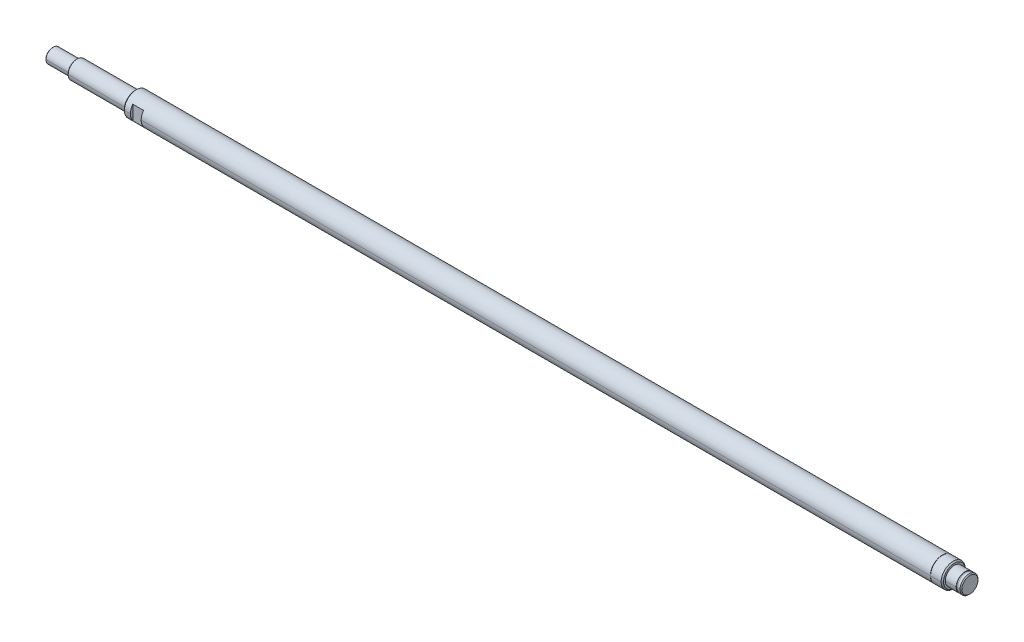
ISO-10303-21;
HEADER;
FILE_DESCRIPTION(('STEP AP214'),'2;1');
FILE_NAME('part.step','',(''),(''),'','','');
FILE_SCHEMA(('AUTOMOTIVE_DESIGN { 1 0 10303 214 1 1 1 1 }'));
ENDSEC;
DATA;
#1=APPLICATION_CONTEXT('core data for automotive mechanical design processes');
#2=APPLICATION_PROTOCOL_DEFINITION('international standard','automotive_design',2000,#1);
#3=PRODUCT_CONTEXT('',#1,'mechanical');
#4=PRODUCT('Part','Part','',(#3));
#5=PRODUCT_RELATED_PRODUCT_CATEGORY('part','',(#4));
#6=PRODUCT_DEFINITION_FORMATION('','',#4);
#7=PRODUCT_DEFINITION_CONTEXT('part definition',#1,'design');
#8=PRODUCT_DEFINITION('design','',#6,#7);
#9=PRODUCT_DEFINITION_SHAPE('','',#8);
#10=(LENGTH_UNIT() NAMED_UNIT(*) SI_UNIT(.MILLI.,.METRE.));
#11=(NAMED_UNIT(*) PLANE_ANGLE_UNIT() SI_UNIT($,.RADIAN.));
#12=(NAMED_UNIT(*) SI_UNIT($,.STERADIAN.) SOLID_ANGLE_UNIT());
#13=UNCERTAINTY_MEASURE_WITH_UNIT(LENGTH_MEASURE(1.E-05),#10,'distance_accuracy_value','');
#14=(GEOMETRIC_REPRESENTATION_CONTEXT(3) GLOBAL_UNCERTAINTY_ASSIGNED_CONTEXT((#13)) GLOBAL_UNIT_ASSIGNED_CONTEXT((#10,
#11,#12)) REPRESENTATION_CONTEXT('',''));
#15=CARTESIAN_POINT('',(0.,0.,0.));
#16=DIRECTION('',(0.,0.,1.));
#17=DIRECTION('',(1.,0.,0.));
#18=AXIS2_PLACEMENT_3D('',#15,#16,#17);
#19=CARTESIAN_POINT('',(658.5,0.,0.));
#20=DIRECTION('',(1.,0.,0.));
#21=DIRECTION('',(0.,1.,0.));
#22=AXIS2_PLACEMENT_3D('',#19,#20,#21);
#23=CYLINDRICAL_SURFACE('',#22,10.);
#24=DIRECTION('',(1.,0.,0.));
#25=VECTOR('',#24,1.);
#26=CARTESIAN_POINT('',(-14.,0.,10.));
#27=LINE('',#26,#25);
#28=CARTESIAN_POINT('',(-14.,0.,10.));
#29=VERTEX_POINT('',#28);
#30=CARTESIAN_POINT('',(-9.,0.,10.));
#31=VERTEX_POINT('',#30);
#32=EDGE_CURVE('E11',#29,#31,#27,.T.);
#33=ORIENTED_EDGE('',*,*,#32,.F.);
#34=CARTESIAN_POINT('',(-14.,0.,0.));
#35=DIRECTION('',(1.,0.,0.));
#36=DIRECTION('',(0.,0.,-1.));
#37=AXIS2_PLACEMENT_3D('',#34,#35,#36);
#38=CIRCLE('',#37,10.);
#39=CARTESIAN_POINT('',(-14.,0.,-10.));
#40=VERTEX_POINT('',#39);
#41=EDGE_CURVE('E25',#29,#40,#38,.T.);
#42=ORIENTED_EDGE('',*,*,#41,.T.);
#43=DIRECTION('',(1.,0.,0.));
#44=VECTOR('',#43,1.);
#45=CARTESIAN_POINT('',(-14.,0.,-10.));
#46=LINE('',#45,#44);
#47=CARTESIAN_POINT('',(-9.,0.,-10.));
#48=VERTEX_POINT('',#47);
#49=EDGE_CURVE('E588',#40,#48,#46,.T.);
#50=ORIENTED_EDGE('',*,*,#49,.T.);
#51=CARTESIAN_POINT('',(-9.,0.,0.));
#52=DIRECTION('',(-1.,0.,0.));
#53=DIRECTION('',(0.,0.,1.));
#54=AXIS2_PLACEMENT_3D('',#51,#52,#53);
#55=CIRCLE('',#54,10.);
#56=CARTESIAN_POINT('',(-9.,-6.,-8.));
#57=VERTEX_POINT('',#56);
#58=EDGE_CURVE('E584',#48,#57,#55,.T.);
#59=ORIENTED_EDGE('',*,*,#58,.T.);
#60=DIRECTION('',(1.,0.,0.));
#61=VECTOR('',#60,1.);
#62=CARTESIAN_POINT('',(658.5,-6.,-8.));
#63=LINE('',#62,#61);
#64=CARTESIAN_POINT('',(0.,-6.,-8.));
#65=VERTEX_POINT('',#64);
#66=EDGE_CURVE('E580',#57,#65,#63,.T.);
#67=ORIENTED_EDGE('',*,*,#66,.T.);
#68=CARTESIAN_POINT('',(0.,0.,0.));
#69=DIRECTION('',(1.,0.,0.));
#70=DIRECTION('',(0.,0.,-1.));
#71=AXIS2_PLACEMENT_3D('',#68,#69,#70);
#72=CIRCLE('',#71,10.);
#73=CARTESIAN_POINT('',(0.,0.,-10.));
#74=VERTEX_POINT('',#73);
#75=EDGE_CURVE('E576',#65,#74,#72,.T.);
#76=ORIENTED_EDGE('',*,*,#75,.T.);
#77=DIRECTION('',(1.,0.,0.));
#78=VECTOR('',#77,1.);
#79=CARTESIAN_POINT('',(0.,0.,-10.));
#80=LINE('',#79,#78);
#81=CARTESIAN_POINT('',(658.5,0.,-10.));
#82=VERTEX_POINT('',#81);
#83=EDGE_CURVE('E572',#74,#82,#80,.T.);
#84=ORIENTED_EDGE('',*,*,#83,.T.);
#85=CARTESIAN_POINT('',(658.5,0.,0.));
#86=DIRECTION('',(1.,0.,0.));
#87=DIRECTION('',(0.,0.,-1.));
#88=AXIS2_PLACEMENT_3D('',#85,#86,#87);
#89=CIRCLE('',#88,10.);
#90=CARTESIAN_POINT('',(658.5,0.,10.));
#91=VERTEX_POINT('',#90);
#92=EDGE_CURVE('E567',#91,#82,#89,.T.);
#93=ORIENTED_EDGE('',*,*,#92,.F.);
#94=DIRECTION('',(1.,0.,0.));
#95=VECTOR('',#94,1.);
#96=CARTESIAN_POINT('',(0.,0.,10.));
#97=LINE('',#96,#95);
#98=CARTESIAN_POINT('',(0.,0.,10.));
#99=VERTEX_POINT('',#98);
#100=EDGE_CURVE('E562',#99,#91,#97,.T.);
#101=ORIENTED_EDGE('',*,*,#100,.F.);
#102=CARTESIAN_POINT('',(0.,0.,0.));
#103=DIRECTION('',(-1.,0.,0.));
#104=DIRECTION('',(0.,0.,1.));
#105=AXIS2_PLACEMENT_3D('',#102,#103,#104);
#106=CIRCLE('',#105,10.);
#107=CARTESIAN_POINT('',(0.,-6.,8.));
#108=VERTEX_POINT('',#107);
#109=EDGE_CURVE('E557',#108,#99,#106,.T.);
#110=ORIENTED_EDGE('',*,*,#109,.F.);
#111=DIRECTION('',(1.,0.,0.));
#112=VECTOR('',#111,1.);
#113=CARTESIAN_POINT('',(658.5,-6.,8.));
#114=LINE('',#113,#112);
#115=CARTESIAN_POINT('',(-9.,-6.,8.));
#116=VERTEX_POINT('',#115);
#117=EDGE_CURVE('E552',#116,#108,#114,.T.);
#118=ORIENTED_EDGE('',*,*,#117,.F.);
#119=CARTESIAN_POINT('',(-9.,0.,0.));
#120=DIRECTION('',(1.,0.,0.));
#121=DIRECTION('',(0.,0.,-1.));
#122=AXIS2_PLACEMENT_3D('',#119,#120,#121);
#123=CIRCLE('',#122,10.);
#124=EDGE_CURVE('E547',#31,#116,#123,.T.);
#125=ORIENTED_EDGE('',*,*,#124,.F.);
#126=EDGE_LOOP('',(#33,#42,#50,#59,#67,#76,#84,#93,#101,#110,#118,#125));
#127=FACE_BOUND('',#126,.T.);
#128=ADVANCED_FACE('F17',(#127),#23,.T.);
#129=CARTESIAN_POINT('',(-9.,10.,12.));
#130=DIRECTION('',(1.,0.,0.));
#131=DIRECTION('',(0.,0.,-1.));
#132=AXIS2_PLACEMENT_3D('',#129,#130,#131);
#133=PLANE('',#132);
#134=CARTESIAN_POINT('',(-9.,0.,0.));
#135=DIRECTION('',(1.,0.,0.));
#136=DIRECTION('',(0.,0.,-1.));
#137=AXIS2_PLACEMENT_3D('',#134,#135,#136);
#138=CIRCLE('',#137,10.);
#139=CARTESIAN_POINT('',(-9.,6.,8.));
#140=VERTEX_POINT('',#139);
#141=EDGE_CURVE('E542',#140,#31,#138,.T.);
#142=ORIENTED_EDGE('',*,*,#141,.T.);
#143=ORIENTED_EDGE('',*,*,#124,.T.);
#144=DIRECTION('',(0.,-1.,0.));
#145=VECTOR('',#144,1.);
#146=CARTESIAN_POINT('',(-9.,10.,8.));
#147=LINE('',#146,#145);
#148=EDGE_CURVE('E537',#140,#116,#147,.T.);
#149=ORIENTED_EDGE('',*,*,#148,.F.);
#150=EDGE_LOOP('',(#142,#143,#149));
#151=FACE_BOUND('',#150,.T.);
#152=ADVANCED_FACE('F626',(#151),#133,.T.);
#153=CARTESIAN_POINT('',(0.,0.,8.));
#154=DIRECTION('',(0.,0.,1.));
#155=DIRECTION('',(1.,0.,0.));
#156=AXIS2_PLACEMENT_3D('',#153,#154,#155);
#157=PLANE('',#156);
#158=ORIENTED_EDGE('',*,*,#117,.T.);
#159=DIRECTION('',(0.,1.,0.));
#160=VECTOR('',#159,1.);
#161=CARTESIAN_POINT('',(0.,-10.,8.));
#162=LINE('',#161,#160);
#163=CARTESIAN_POINT('',(0.,6.,8.));
#164=VERTEX_POINT('',#163);
#165=EDGE_CURVE('E533',#108,#164,#162,.T.);
#166=ORIENTED_EDGE('',*,*,#165,.T.);
#167=DIRECTION('',(-1.,0.,0.));
#168=VECTOR('',#167,1.);
#169=CARTESIAN_POINT('',(658.5,6.,8.));
#170=LINE('',#169,#168);
#171=EDGE_CURVE('E528',#164,#140,#170,.T.);
#172=ORIENTED_EDGE('',*,*,#171,.T.);
#173=ORIENTED_EDGE('',*,*,#148,.T.);
#174=EDGE_LOOP('',(#158,#166,#172,#173));
#175=FACE_BOUND('',#174,.T.);
#176=ADVANCED_FACE('F624',(#175),#157,.T.);
#177=CARTESIAN_POINT('',(658.5,0.,0.));
#178=DIRECTION('',(1.,0.,0.));
#179=DIRECTION('',(0.,-1.,0.));
#180=AXIS2_PLACEMENT_3D('',#177,#178,#179);
#181=CYLINDRICAL_SURFACE('',#180,10.);
#182=ORIENTED_EDGE('',*,*,#32,.T.);
#183=ORIENTED_EDGE('',*,*,#141,.F.);
#184=ORIENTED_EDGE('',*,*,#171,.F.);
#185=CARTESIAN_POINT('',(0.,0.,0.));
#186=DIRECTION('',(-1.,0.,0.));
#187=DIRECTION('',(0.,0.,1.));
#188=AXIS2_PLACEMENT_3D('',#185,#186,#187);
#189=CIRCLE('',#188,10.);
#190=EDGE_CURVE('E523',#99,#164,#189,.T.);
#191=ORIENTED_EDGE('',*,*,#190,.F.);
#192=ORIENTED_EDGE('',*,*,#100,.T.);
#193=CARTESIAN_POINT('',(658.5,0.,0.));
#194=DIRECTION('',(1.,0.,0.));
#195=DIRECTION('',(0.,0.,-1.));
#196=AXIS2_PLACEMENT_3D('',#193,#194,#195);
#197=CIRCLE('',#196,10.);
#198=EDGE_CURVE('E518',#82,#91,#197,.T.);
#199=ORIENTED_EDGE('',*,*,#198,.F.);
#200=ORIENTED_EDGE('',*,*,#83,.F.);
#201=CARTESIAN_POINT('',(0.,0.,0.));
#202=DIRECTION('',(1.,0.,0.));
#203=DIRECTION('',(0.,0.,-1.));
#204=AXIS2_PLACEMENT_3D('',#201,#202,#203);
#205=CIRCLE('',#204,10.);
#206=CARTESIAN_POINT('',(0.,6.,-8.));
#207=VERTEX_POINT('',#206);
#208=EDGE_CURVE('E514',#74,#207,#205,.T.);
#209=ORIENTED_EDGE('',*,*,#208,.T.);
#210=DIRECTION('',(-1.,0.,0.));
#211=VECTOR('',#210,1.);
#212=CARTESIAN_POINT('',(658.5,6.,-8.));
#213=LINE('',#212,#211);
#214=CARTESIAN_POINT('',(-9.,6.,-8.));
#215=VERTEX_POINT('',#214);
#216=EDGE_CURVE('E510',#207,#215,#213,.T.);
#217=ORIENTED_EDGE('',*,*,#216,.T.);
#218=CARTESIAN_POINT('',(-9.,0.,0.));
#219=DIRECTION('',(-1.,0.,0.));
#220=DIRECTION('',(0.,0.,1.));
#221=AXIS2_PLACEMENT_3D('',#218,#219,#220);
#222=CIRCLE('',#221,10.);
#223=EDGE_CURVE('E505',#215,#48,#222,.T.);
#224=ORIENTED_EDGE('',*,*,#223,.T.);
#225=ORIENTED_EDGE('',*,*,#49,.F.);
#226=CARTESIAN_POINT('',(-14.,0.,0.));
#227=DIRECTION('',(1.,0.,0.));
#228=DIRECTION('',(0.,0.,-1.));
#229=AXIS2_PLACEMENT_3D('',#226,#227,#228);
#230=CIRCLE('',#229,10.);
#231=EDGE_CURVE('E501',#40,#29,#230,.T.);
#232=ORIENTED_EDGE('',*,*,#231,.T.);
#233=EDGE_LOOP('',(#182,#183,#184,#191,#192,#199,#200,#209,#217,#224,#225,#232));
#234=FACE_BOUND('',#233,.T.);
#235=ADVANCED_FACE('F600',(#234),#181,.T.);
#236=CARTESIAN_POINT('',(-15.,0.,0.));
#237=DIRECTION('',(1.,0.,0.));
#238=DIRECTION('',(0.,-1.,0.));
#239=AXIS2_PLACEMENT_3D('',#236,#237,#238);
#240=CONICAL_SURFACE('',#239,9.,0.785398163397448);
#241=DIRECTION('',(0.707106781186548,0.,0.707106781186547));
#242=VECTOR('',#241,1.);
#243=CARTESIAN_POINT('',(-15.,0.,9.));
#244=LINE('',#243,#242);
#245=CARTESIAN_POINT('',(-15.,0.,9.));
#246=VERTEX_POINT('',#245);
#247=EDGE_CURVE('E496',#246,#29,#244,.T.);
#248=ORIENTED_EDGE('',*,*,#247,.T.);
#249=ORIENTED_EDGE('',*,*,#231,.F.);
#250=DIRECTION('',(0.707106781186548,0.,-0.707106781186547));
#251=VECTOR('',#250,1.);
#252=CARTESIAN_POINT('',(-15.,0.,-9.));
#253=LINE('',#252,#251);
#254=CARTESIAN_POINT('',(-15.,0.,-9.));
#255=VERTEX_POINT('',#254);
#256=EDGE_CURVE('E492',#255,#40,#253,.T.);
#257=ORIENTED_EDGE('',*,*,#256,.F.);
#258=CARTESIAN_POINT('',(-15.,0.,0.));
#259=DIRECTION('',(1.,0.,0.));
#260=DIRECTION('',(0.,0.,-1.));
#261=AXIS2_PLACEMENT_3D('',#258,#259,#260);
#262=CIRCLE('',#261,9.);
#263=EDGE_CURVE('E488',#255,#246,#262,.T.);
#264=ORIENTED_EDGE('',*,*,#263,.T.);
#265=EDGE_LOOP('',(#248,#249,#257,#264));
#266=FACE_BOUND('',#265,.T.);
#267=ADVANCED_FACE('F630',(#266),#240,.T.);
#268=CARTESIAN_POINT('',(-15.,0.,-7.5));
#269=DIRECTION('',(1.,0.,0.));
#270=DIRECTION('',(0.,0.,-1.));
#271=AXIS2_PLACEMENT_3D('',#268,#269,#270);
#272=PLANE('',#271);
#273=CARTESIAN_POINT('',(-15.,0.,0.));
#274=DIRECTION('',(1.,0.,0.));
#275=DIRECTION('',(0.,0.,-1.));
#276=AXIS2_PLACEMENT_3D('',#273,#274,#275);
#277=CIRCLE('',#276,9.);
#278=EDGE_CURVE('E483',#246,#255,#277,.T.);
#279=ORIENTED_EDGE('',*,*,#278,.F.);
#280=ORIENTED_EDGE('',*,*,#263,.F.);
#281=EDGE_LOOP('',(#279,#280));
#282=FACE_BOUND('',#281,.T.);
#283=CARTESIAN_POINT('',(-15.,0.,0.));
#284=DIRECTION('',(1.,0.,0.));
#285=DIRECTION('',(0.,0.,-1.));
#286=AXIS2_PLACEMENT_3D('',#283,#284,#285);
#287=CIRCLE('',#286,7.5);
#288=CARTESIAN_POINT('',(-15.,0.,-7.5));
#289=VERTEX_POINT('',#288);
#290=CARTESIAN_POINT('',(-15.,0.,7.5));
#291=VERTEX_POINT('',#290);
#292=EDGE_CURVE('E479',#289,#291,#287,.T.);
#293=ORIENTED_EDGE('',*,*,#292,.T.);
#294=CARTESIAN_POINT('',(-15.,0.,0.));
#295=DIRECTION('',(1.,0.,0.));
#296=DIRECTION('',(0.,0.,-1.));
#297=AXIS2_PLACEMENT_3D('',#294,#295,#296);
#298=CIRCLE('',#297,7.5);
#299=EDGE_CURVE('E475',#291,#289,#298,.T.);
#300=ORIENTED_EDGE('',*,*,#299,.T.);
#301=EDGE_LOOP('',(#293,#300));
#302=FACE_BOUND('',#301,.T.);
#303=ADVANCED_FACE('F636',(#282,#302),#272,.F.);
#304=CARTESIAN_POINT('',(10.,0.,0.));
#305=DIRECTION('',(1.,0.,0.));
#306=DIRECTION('',(0.,1.,0.));
#307=AXIS2_PLACEMENT_3D('',#304,#305,#306);
#308=CYLINDRICAL_SURFACE('',#307,7.5);
#309=DIRECTION('',(1.,0.,0.));
#310=VECTOR('',#309,1.);
#311=CARTESIAN_POINT('',(-63.3865,0.,7.5));
#312=LINE('',#311,#310);
#313=CARTESIAN_POINT('',(-63.3865,0.,7.5));
#314=VERTEX_POINT('',#313);
#315=EDGE_CURVE('E470',#314,#291,#312,.T.);
#316=ORIENTED_EDGE('',*,*,#315,.F.);
#317=CARTESIAN_POINT('',(-63.3865,0.,0.));
#318=DIRECTION('',(1.,0.,0.));
#319=DIRECTION('',(0.,0.,-1.));
#320=AXIS2_PLACEMENT_3D('',#317,#318,#319);
#321=CIRCLE('',#320,7.5);
#322=CARTESIAN_POINT('',(-63.3865,0.,-7.5));
#323=VERTEX_POINT('',#322);
#324=EDGE_CURVE('E466',#314,#323,#321,.T.);
#325=ORIENTED_EDGE('',*,*,#324,.T.);
#326=DIRECTION('',(1.,0.,0.));
#327=VECTOR('',#326,1.);
#328=CARTESIAN_POINT('',(-63.3865,0.,-7.5));
#329=LINE('',#328,#327);
#330=EDGE_CURVE('E461',#323,#289,#329,.T.);
#331=ORIENTED_EDGE('',*,*,#330,.T.);
#332=ORIENTED_EDGE('',*,*,#299,.F.);
#333=EDGE_LOOP('',(#316,#325,#331,#332));
#334=FACE_BOUND('',#333,.T.);
#335=ADVANCED_FACE('F639',(#334),#308,.T.);
#336=CARTESIAN_POINT('',(10.,0.,0.));
#337=DIRECTION('',(1.,0.,0.));
#338=DIRECTION('',(0.,-1.,-2.45264421585441E-11));
#339=AXIS2_PLACEMENT_3D('',#336,#337,#338);
#340=CYLINDRICAL_SURFACE('',#339,7.5);
#341=ORIENTED_EDGE('',*,*,#315,.T.);
#342=ORIENTED_EDGE('',*,*,#292,.F.);
#343=ORIENTED_EDGE('',*,*,#330,.F.);
#344=CARTESIAN_POINT('',(-63.3865,0.,0.));
#345=DIRECTION('',(1.,0.,0.));
#346=DIRECTION('',(0.,0.,-1.));
#347=AXIS2_PLACEMENT_3D('',#344,#345,#346);
#348=CIRCLE('',#347,7.5);
#349=EDGE_CURVE('E456',#323,#314,#348,.T.);
#350=ORIENTED_EDGE('',*,*,#349,.T.);
#351=EDGE_LOOP('',(#341,#342,#343,#350));
#352=FACE_BOUND('',#351,.T.);
#353=ADVANCED_FACE('F646',(#352),#340,.T.);
#354=CARTESIAN_POINT('',(-64.,0.,0.));
#355=DIRECTION('',(1.,0.,0.));
#356=DIRECTION('',(0.,-1.,0.));
#357=AXIS2_PLACEMENT_3D('',#354,#355,#356);
#358=CONICAL_SURFACE('',#357,6.8865,0.785398163397446);
#359=DIRECTION('',(0.707106781186549,0.,0.707106781186546));
#360=VECTOR('',#359,1.);
#361=CARTESIAN_POINT('',(-64.,0.,6.8865));
#362=LINE('',#361,#360);
#363=CARTESIAN_POINT('',(-64.,0.,6.8865));
#364=VERTEX_POINT('',#363);
#365=EDGE_CURVE('E451',#364,#314,#362,.T.);
#366=ORIENTED_EDGE('',*,*,#365,.T.);
#367=ORIENTED_EDGE('',*,*,#349,.F.);
#368=DIRECTION('',(0.707106781186549,0.,-0.707106781186546));
#369=VECTOR('',#368,1.);
#370=CARTESIAN_POINT('',(-64.,0.,-6.8865));
#371=LINE('',#370,#369);
#372=CARTESIAN_POINT('',(-64.,0.,-6.8865));
#373=VERTEX_POINT('',#372);
#374=EDGE_CURVE('E446',#373,#323,#371,.T.);
#375=ORIENTED_EDGE('',*,*,#374,.F.);
#376=CARTESIAN_POINT('',(-64.,0.,0.));
#377=DIRECTION('',(1.,0.,0.));
#378=DIRECTION('',(0.,0.,-1.));
#379=AXIS2_PLACEMENT_3D('',#376,#377,#378);
#380=CIRCLE('',#379,6.8865);
#381=EDGE_CURVE('E442',#373,#364,#380,.T.);
#382=ORIENTED_EDGE('',*,*,#381,.T.);
#383=EDGE_LOOP('',(#366,#367,#375,#382));
#384=FACE_BOUND('',#383,.T.);
#385=ADVANCED_FACE('F651',(#384),#358,.T.);
#386=CARTESIAN_POINT('',(-64.,0.,-6.));
#387=DIRECTION('',(1.,0.,0.));
#388=DIRECTION('',(0.,0.,-1.));
#389=AXIS2_PLACEMENT_3D('',#386,#387,#388);
#390=PLANE('',#389);
#391=CARTESIAN_POINT('',(-64.,0.,0.));
#392=DIRECTION('',(1.,0.,0.));
#393=DIRECTION('',(0.,0.,-1.));
#394=AXIS2_PLACEMENT_3D('',#391,#392,#393);
#395=CIRCLE('',#394,6.8865);
#396=EDGE_CURVE('E437',#364,#373,#395,.T.);
#397=ORIENTED_EDGE('',*,*,#396,.F.);
#398=ORIENTED_EDGE('',*,*,#381,.F.);
#399=EDGE_LOOP('',(#397,#398));
#400=FACE_BOUND('',#399,.T.);
#401=CARTESIAN_POINT('',(-64.,0.,0.));
#402=DIRECTION('',(1.,0.,0.));
#403=DIRECTION('',(0.,0.,-1.));
#404=AXIS2_PLACEMENT_3D('',#401,#402,#403);
#405=CIRCLE('',#404,6.);
#406=CARTESIAN_POINT('',(-64.,0.,-6.));
#407=VERTEX_POINT('',#406);
#408=CARTESIAN_POINT('',(-64.,0.,6.));
#409=VERTEX_POINT('',#408);
#410=EDGE_CURVE('E433',#407,#409,#405,.T.);
#411=ORIENTED_EDGE('',*,*,#410,.T.);
#412=CARTESIAN_POINT('',(-64.,0.,0.));
#413=DIRECTION('',(1.,0.,0.));
#414=DIRECTION('',(0.,0.,-1.));
#415=AXIS2_PLACEMENT_3D('',#412,#413,#414);
#416=CIRCLE('',#415,6.);
#417=EDGE_CURVE('E429',#409,#407,#416,.T.);
#418=ORIENTED_EDGE('',*,*,#417,.T.);
#419=EDGE_LOOP('',(#411,#418));
#420=FACE_BOUND('',#419,.T.);
#421=ADVANCED_FACE('F657',(#400,#420),#390,.F.);
#422=CARTESIAN_POINT('',(10.,0.,0.));
#423=DIRECTION('',(1.,0.,0.));
#424=DIRECTION('',(0.,1.,0.));
#425=AXIS2_PLACEMENT_3D('',#422,#423,#424);
#426=CYLINDRICAL_SURFACE('',#425,6.);
#427=DIRECTION('',(1.,0.,0.));
#428=VECTOR('',#427,1.);
#429=CARTESIAN_POINT('',(-83.4,0.,6.));
#430=LINE('',#429,#428);
#431=CARTESIAN_POINT('',(-83.4,0.,6.));
#432=VERTEX_POINT('',#431);
#433=EDGE_CURVE('E424',#432,#409,#430,.T.);
#434=ORIENTED_EDGE('',*,*,#433,.F.);
#435=CARTESIAN_POINT('',(-83.4,0.,0.));
#436=DIRECTION('',(1.,0.,0.));
#437=DIRECTION('',(0.,0.,-1.));
#438=AXIS2_PLACEMENT_3D('',#435,#436,#437);
#439=CIRCLE('',#438,6.);
#440=CARTESIAN_POINT('',(-83.4,0.,-6.));
#441=VERTEX_POINT('',#440);
#442=EDGE_CURVE('E420',#432,#441,#439,.T.);
#443=ORIENTED_EDGE('',*,*,#442,.T.);
#444=DIRECTION('',(1.,0.,0.));
#445=VECTOR('',#444,1.);
#446=CARTESIAN_POINT('',(-83.4,0.,-6.));
#447=LINE('',#446,#445);
#448=EDGE_CURVE('E415',#441,#407,#447,.T.);
#449=ORIENTED_EDGE('',*,*,#448,.T.);
#450=ORIENTED_EDGE('',*,*,#417,.F.);
#451=EDGE_LOOP('',(#434,#443,#449,#450));
#452=FACE_BOUND('',#451,.T.);
#453=ADVANCED_FACE('F660',(#452),#426,.T.);
#454=CARTESIAN_POINT('',(10.,0.,0.));
#455=DIRECTION('',(1.,0.,0.));
#456=DIRECTION('',(0.,-1.,0.));
#457=AXIS2_PLACEMENT_3D('',#454,#455,#456);
#458=CYLINDRICAL_SURFACE('',#457,6.);
#459=ORIENTED_EDGE('',*,*,#433,.T.);
#460=ORIENTED_EDGE('',*,*,#410,.F.);
#461=ORIENTED_EDGE('',*,*,#448,.F.);
#462=CARTESIAN_POINT('',(-83.4,0.,0.));
#463=DIRECTION('',(1.,0.,0.));
#464=DIRECTION('',(0.,0.,-1.));
#465=AXIS2_PLACEMENT_3D('',#462,#463,#464);
#466=CIRCLE('',#465,6.);
#467=EDGE_CURVE('E410',#441,#432,#466,.T.);
#468=ORIENTED_EDGE('',*,*,#467,.T.);
#469=EDGE_LOOP('',(#459,#460,#461,#468));
#470=FACE_BOUND('',#469,.T.);
#471=ADVANCED_FACE('F667',(#470),#458,.T.);
#472=CARTESIAN_POINT('',(-84.,0.,0.));
#473=DIRECTION('',(1.,0.,0.));
#474=DIRECTION('',(0.,-1.,0.));
#475=AXIS2_PLACEMENT_3D('',#472,#473,#474);
#476=CONICAL_SURFACE('',#475,5.4,0.785398163397446);
#477=DIRECTION('',(0.707106781186547,0.,0.707106781186548));
#478=VECTOR('',#477,1.);
#479=CARTESIAN_POINT('',(-84.,0.,5.4));
#480=LINE('',#479,#478);
#481=CARTESIAN_POINT('',(-84.,0.,5.4));
#482=VERTEX_POINT('',#481);
#483=EDGE_CURVE('E405',#482,#432,#480,.T.);
#484=ORIENTED_EDGE('',*,*,#483,.T.);
#485=ORIENTED_EDGE('',*,*,#467,.F.);
#486=DIRECTION('',(0.707106781186547,0.,-0.707106781186548));
#487=VECTOR('',#486,1.);
#488=CARTESIAN_POINT('',(-84.,0.,-5.4));
#489=LINE('',#488,#487);
#490=CARTESIAN_POINT('',(-84.,0.,-5.4));
#491=VERTEX_POINT('',#490);
#492=EDGE_CURVE('E400',#491,#441,#489,.T.);
#493=ORIENTED_EDGE('',*,*,#492,.F.);
#494=CARTESIAN_POINT('',(-84.,0.,0.));
#495=DIRECTION('',(1.,0.,0.));
#496=DIRECTION('',(0.,0.,-1.));
#497=AXIS2_PLACEMENT_3D('',#494,#495,#496);
#498=CIRCLE('',#497,5.4);
#499=EDGE_CURVE('E396',#491,#482,#498,.T.);
#500=ORIENTED_EDGE('',*,*,#499,.T.);
#501=EDGE_LOOP('',(#484,#485,#493,#500));
#502=FACE_BOUND('',#501,.T.);
#503=ADVANCED_FACE('F672',(#502),#476,.T.);
#504=CARTESIAN_POINT('',(-84.,0.,0.));
#505=DIRECTION('',(1.,0.,0.));
#506=DIRECTION('',(0.,0.,-1.));
#507=AXIS2_PLACEMENT_3D('',#504,#505,#506);
#508=PLANE('',#507);
#509=CARTESIAN_POINT('',(-84.,0.,0.));
#510=DIRECTION('',(1.,0.,0.));
#511=DIRECTION('',(0.,0.,-1.));
#512=AXIS2_PLACEMENT_3D('',#509,#510,#511);
#513=CIRCLE('',#512,5.4);
#514=EDGE_CURVE('E391',#482,#491,#513,.T.);
#515=ORIENTED_EDGE('',*,*,#514,.F.);
#516=ORIENTED_EDGE('',*,*,#499,.F.);
#517=EDGE_LOOP('',(#515,#516));
#518=FACE_BOUND('',#517,.T.);
#519=ADVANCED_FACE('F678',(#518),#508,.F.);
#520=CARTESIAN_POINT('',(-84.,0.,0.));
#521=DIRECTION('',(1.,0.,0.));
#522=DIRECTION('',(0.,1.,0.));
#523=AXIS2_PLACEMENT_3D('',#520,#521,#522);
#524=CONICAL_SURFACE('',#523,5.4,0.785398163397446);
#525=ORIENTED_EDGE('',*,*,#483,.F.);
#526=ORIENTED_EDGE('',*,*,#514,.T.);
#527=ORIENTED_EDGE('',*,*,#492,.T.);
#528=ORIENTED_EDGE('',*,*,#442,.F.);
#529=EDGE_LOOP('',(#525,#526,#527,#528));
#530=FACE_BOUND('',#529,.T.);
#531=ADVANCED_FACE('F676',(#530),#524,.T.);
#532=CARTESIAN_POINT('',(-64.,0.,0.));
#533=DIRECTION('',(1.,0.,0.));
#534=DIRECTION('',(0.,1.,0.));
#535=AXIS2_PLACEMENT_3D('',#532,#533,#534);
#536=CONICAL_SURFACE('',#535,6.8865,0.785398163397446);
#537=ORIENTED_EDGE('',*,*,#365,.F.);
#538=ORIENTED_EDGE('',*,*,#396,.T.);
#539=ORIENTED_EDGE('',*,*,#374,.T.);
#540=ORIENTED_EDGE('',*,*,#324,.F.);
#541=EDGE_LOOP('',(#537,#538,#539,#540));
#542=FACE_BOUND('',#541,.T.);
#543=ADVANCED_FACE('F655',(#542),#536,.T.);
#544=CARTESIAN_POINT('',(-15.,0.,0.));
#545=DIRECTION('',(1.,0.,0.));
#546=DIRECTION('',(0.,1.,0.));
#547=AXIS2_PLACEMENT_3D('',#544,#545,#546);
#548=CONICAL_SURFACE('',#547,9.,0.785398163397448);
#549=ORIENTED_EDGE('',*,*,#247,.F.);
#550=ORIENTED_EDGE('',*,*,#278,.T.);
#551=ORIENTED_EDGE('',*,*,#256,.T.);
#552=ORIENTED_EDGE('',*,*,#41,.F.);
#553=EDGE_LOOP('',(#549,#550,#551,#552));
#554=FACE_BOUND('',#553,.T.);
#555=ADVANCED_FACE('F634',(#554),#548,.T.);
#556=CARTESIAN_POINT('',(-9.,10.,-12.));
#557=DIRECTION('',(-1.,0.,0.));
#558=DIRECTION('',(0.,0.,1.));
#559=AXIS2_PLACEMENT_3D('',#556,#557,#558);
#560=PLANE('',#559);
#561=DIRECTION('',(0.,-1.,0.));
#562=VECTOR('',#561,1.);
#563=CARTESIAN_POINT('',(-9.,10.,-8.));
#564=LINE('',#563,#562);
#565=EDGE_CURVE('E386',#215,#57,#564,.T.);
#566=ORIENTED_EDGE('',*,*,#565,.T.);
#567=ORIENTED_EDGE('',*,*,#58,.F.);
#568=ORIENTED_EDGE('',*,*,#223,.F.);
#569=EDGE_LOOP('',(#566,#567,#568));
#570=FACE_BOUND('',#569,.T.);
#571=ADVANCED_FACE('F604',(#570),#560,.F.);
#572=CARTESIAN_POINT('',(0.,0.,-8.));
#573=DIRECTION('',(0.,0.,1.));
#574=DIRECTION('',(1.,0.,0.));
#575=AXIS2_PLACEMENT_3D('',#572,#573,#574);
#576=PLANE('',#575);
#577=ORIENTED_EDGE('',*,*,#565,.F.);
#578=ORIENTED_EDGE('',*,*,#216,.F.);
#579=DIRECTION('',(0.,1.,0.));
#580=VECTOR('',#579,1.);
#581=CARTESIAN_POINT('',(0.,-10.,-8.));
#582=LINE('',#581,#580);
#583=EDGE_CURVE('E381',#65,#207,#582,.T.);
#584=ORIENTED_EDGE('',*,*,#583,.F.);
#585=ORIENTED_EDGE('',*,*,#66,.F.);
#586=EDGE_LOOP('',(#577,#578,#584,#585));
#587=FACE_BOUND('',#586,.T.);
#588=ADVANCED_FACE('F608',(#587),#576,.F.);
#589=CARTESIAN_POINT('',(0.,-10.,-12.));
#590=DIRECTION('',(1.,0.,0.));
#591=DIRECTION('',(0.,0.,-1.));
#592=AXIS2_PLACEMENT_3D('',#589,#590,#591);
#593=PLANE('',#592);
#594=ORIENTED_EDGE('',*,*,#208,.F.);
#595=ORIENTED_EDGE('',*,*,#75,.F.);
#596=ORIENTED_EDGE('',*,*,#583,.T.);
#597=EDGE_LOOP('',(#594,#595,#596));
#598=FACE_BOUND('',#597,.T.);
#599=ADVANCED_FACE('F614',(#598),#593,.F.);
#600=CARTESIAN_POINT('',(658.5,10.,0.));
#601=DIRECTION('',(-1.,0.,0.));
#602=DIRECTION('',(0.,0.,1.));
#603=AXIS2_PLACEMENT_3D('',#600,#601,#602);
#604=PLANE('',#603);
#605=CARTESIAN_POINT('',(658.5,0.,0.));
#606=DIRECTION('',(1.,0.,0.));
#607=DIRECTION('',(0.,0.,-1.));
#608=AXIS2_PLACEMENT_3D('',#605,#606,#607);
#609=CIRCLE('',#608,8.);
#610=CARTESIAN_POINT('',(658.5,0.,8.));
#611=VERTEX_POINT('',#610);
#612=CARTESIAN_POINT('',(658.5,0.,-8.));
#613=VERTEX_POINT('',#612);
#614=EDGE_CURVE('E376',#611,#613,#609,.T.);
#615=ORIENTED_EDGE('',*,*,#614,.F.);
#616=CARTESIAN_POINT('',(658.5,0.,0.));
#617=DIRECTION('',(1.,0.,0.));
#618=DIRECTION('',(0.,0.,-1.));
#619=AXIS2_PLACEMENT_3D('',#616,#617,#618);
#620=CIRCLE('',#619,8.);
#621=EDGE_CURVE('E371',#613,#611,#620,.T.);
#622=ORIENTED_EDGE('',*,*,#621,.F.);
#623=EDGE_LOOP('',(#615,#622));
#624=FACE_BOUND('',#623,.T.);
#625=ORIENTED_EDGE('',*,*,#198,.T.);
#626=ORIENTED_EDGE('',*,*,#92,.T.);
#627=EDGE_LOOP('',(#625,#626));
#628=FACE_BOUND('',#627,.T.);
#629=ADVANCED_FACE('F617',(#624,#628),#604,.F.);
#630=CARTESIAN_POINT('',(681.5,0.,0.));
#631=DIRECTION('',(1.,0.,0.));
#632=DIRECTION('',(0.,-1.,0.));
#633=AXIS2_PLACEMENT_3D('',#630,#631,#632);
#634=CYLINDRICAL_SURFACE('',#633,8.);
#635=DIRECTION('',(1.,0.,0.));
#636=VECTOR('',#635,1.);
#637=CARTESIAN_POINT('',(658.5,0.,8.));
#638=LINE('',#637,#636);
#639=CARTESIAN_POINT('',(658.7,0.,8.));
#640=VERTEX_POINT('',#639);
#641=EDGE_CURVE('E367',#611,#640,#638,.T.);
#642=ORIENTED_EDGE('',*,*,#641,.T.);
#643=CARTESIAN_POINT('',(658.7,0.,0.));
#644=DIRECTION('',(1.,0.,0.));
#645=DIRECTION('',(0.,0.,-1.));
#646=AXIS2_PLACEMENT_3D('',#643,#644,#645);
#647=CIRCLE('',#646,8.);
#648=CARTESIAN_POINT('',(658.7,0.,-8.));
#649=VERTEX_POINT('',#648);
#650=EDGE_CURVE('E362',#649,#640,#647,.T.);
#651=ORIENTED_EDGE('',*,*,#650,.F.);
#652=DIRECTION('',(1.,0.,0.));
#653=VECTOR('',#652,1.);
#654=CARTESIAN_POINT('',(658.5,0.,-8.));
#655=LINE('',#654,#653);
#656=EDGE_CURVE('E357',#613,#649,#655,.T.);
#657=ORIENTED_EDGE('',*,*,#656,.F.);
#658=ORIENTED_EDGE('',*,*,#621,.T.);
#659=EDGE_LOOP('',(#642,#651,#657,#658));
#660=FACE_BOUND('',#659,.T.);
#661=ADVANCED_FACE('F790',(#660),#634,.T.);
#662=CARTESIAN_POINT('',(681.5,0.,0.));
#663=DIRECTION('',(1.,0.,0.));
#664=DIRECTION('',(0.,1.,0.));
#665=AXIS2_PLACEMENT_3D('',#662,#663,#664);
#666=CYLINDRICAL_SURFACE('',#665,8.);
#667=ORIENTED_EDGE('',*,*,#641,.F.);
#668=ORIENTED_EDGE('',*,*,#614,.T.);
#669=ORIENTED_EDGE('',*,*,#656,.T.);
#670=CARTESIAN_POINT('',(658.7,0.,0.));
#671=DIRECTION('',(1.,0.,0.));
#672=DIRECTION('',(0.,0.,-1.));
#673=AXIS2_PLACEMENT_3D('',#670,#671,#672);
#674=CIRCLE('',#673,8.);
#675=EDGE_CURVE('E352',#640,#649,#674,.T.);
#676=ORIENTED_EDGE('',*,*,#675,.F.);
#677=EDGE_LOOP('',(#667,#668,#669,#676));
#678=FACE_BOUND('',#677,.T.);
#679=ADVANCED_FACE('F801',(#678),#666,.T.);
#680=CARTESIAN_POINT('',(658.7,8.,0.));
#681=DIRECTION('',(1.,0.,0.));
#682=DIRECTION('',(0.,0.,-1.));
#683=AXIS2_PLACEMENT_3D('',#680,#681,#682);
#684=PLANE('',#683);
#685=CARTESIAN_POINT('',(658.7,0.,0.));
#686=DIRECTION('',(1.,0.,0.));
#687=DIRECTION('',(0.,0.,-1.));
#688=AXIS2_PLACEMENT_3D('',#685,#686,#687);
#689=CIRCLE('',#688,10.);
#690=CARTESIAN_POINT('',(658.7,0.,10.));
#691=VERTEX_POINT('',#690);
#692=CARTESIAN_POINT('',(658.7,0.,-10.));
#693=VERTEX_POINT('',#692);
#694=EDGE_CURVE('E347',#691,#693,#689,.T.);
#695=ORIENTED_EDGE('',*,*,#694,.F.);
#696=CARTESIAN_POINT('',(658.7,0.,0.));
#697=DIRECTION('',(1.,0.,0.));
#698=DIRECTION('',(0.,0.,-1.));
#699=AXIS2_PLACEMENT_3D('',#696,#697,#698);
#700=CIRCLE('',#699,10.);
#701=EDGE_CURVE('E342',#693,#691,#700,.T.);
#702=ORIENTED_EDGE('',*,*,#701,.F.);
#703=EDGE_LOOP('',(#695,#702));
#704=FACE_BOUND('',#703,.T.);
#705=ORIENTED_EDGE('',*,*,#650,.T.);
#706=ORIENTED_EDGE('',*,*,#675,.T.);
#707=EDGE_LOOP('',(#705,#706));
#708=FACE_BOUND('',#707,.T.);
#709=ADVANCED_FACE('F812',(#704,#708),#684,.F.);
#710=CARTESIAN_POINT('',(681.5,0.,0.));
#711=DIRECTION('',(1.,0.,0.));
#712=DIRECTION('',(0.,-1.,-7.04620268042598E-12));
#713=AXIS2_PLACEMENT_3D('',#710,#711,#712);
#714=CYLINDRICAL_SURFACE('',#713,10.);
#715=DIRECTION('',(1.,0.,0.));
#716=VECTOR('',#715,1.);
#717=CARTESIAN_POINT('',(658.7,0.,10.));
#718=LINE('',#717,#716);
#719=CARTESIAN_POINT('',(667.5,0.,10.));
#720=VERTEX_POINT('',#719);
#721=EDGE_CURVE('E338',#691,#720,#718,.T.);
#722=ORIENTED_EDGE('',*,*,#721,.T.);
#723=CARTESIAN_POINT('',(667.5,0.,0.));
#724=DIRECTION('',(1.,0.,0.));
#725=DIRECTION('',(0.,0.,-1.));
#726=AXIS2_PLACEMENT_3D('',#723,#724,#725);
#727=CIRCLE('',#726,10.);
#728=CARTESIAN_POINT('',(667.5,0.,-10.));
#729=VERTEX_POINT('',#728);
#730=EDGE_CURVE('E333',#729,#720,#727,.T.);
#731=ORIENTED_EDGE('',*,*,#730,.F.);
#732=DIRECTION('',(1.,0.,0.));
#733=VECTOR('',#732,1.);
#734=CARTESIAN_POINT('',(658.7,0.,-10.));
#735=LINE('',#734,#733);
#736=EDGE_CURVE('E328',#693,#729,#735,.T.);
#737=ORIENTED_EDGE('',*,*,#736,.F.);
#738=ORIENTED_EDGE('',*,*,#701,.T.);
#739=EDGE_LOOP('',(#722,#731,#737,#738));
#740=FACE_BOUND('',#739,.T.);
#741=ADVANCED_FACE('F823',(#740),#714,.T.);
#742=CARTESIAN_POINT('',(681.5,0.,0.));
#743=DIRECTION('',(1.,0.,0.));
#744=DIRECTION('',(0.,1.,0.));
#745=AXIS2_PLACEMENT_3D('',#742,#743,#744);
#746=CYLINDRICAL_SURFACE('',#745,10.);
#747=ORIENTED_EDGE('',*,*,#721,.F.);
#748=ORIENTED_EDGE('',*,*,#694,.T.);
#749=ORIENTED_EDGE('',*,*,#736,.T.);
#750=CARTESIAN_POINT('',(667.5,0.,0.));
#751=DIRECTION('',(1.,0.,0.));
#752=DIRECTION('',(0.,0.,-1.));
#753=AXIS2_PLACEMENT_3D('',#750,#751,#752);
#754=CIRCLE('',#753,10.);
#755=EDGE_CURVE('E323',#720,#729,#754,.T.);
#756=ORIENTED_EDGE('',*,*,#755,.F.);
#757=EDGE_LOOP('',(#747,#748,#749,#756));
#758=FACE_BOUND('',#757,.T.);
#759=ADVANCED_FACE('F834',(#758),#746,.T.);
#760=CARTESIAN_POINT('',(667.5,0.,0.));
#761=DIRECTION('',(-1.,0.,0.));
#762=DIRECTION('',(0.,1.,0.));
#763=AXIS2_PLACEMENT_3D('',#760,#761,#762);
#764=CONICAL_SURFACE('',#763,10.,0.785398163397448);
#765=DIRECTION('',(-0.707106781186548,0.,-0.707106781186547));
#766=VECTOR('',#765,1.);
#767=CARTESIAN_POINT('',(668.5,0.,-9.));
#768=LINE('',#767,#766);
#769=CARTESIAN_POINT('',(668.5,0.,-9.));
#770=VERTEX_POINT('',#769);
#771=EDGE_CURVE('E318',#770,#729,#768,.T.);
#772=ORIENTED_EDGE('',*,*,#771,.F.);
#773=CARTESIAN_POINT('',(668.5,0.,0.));
#774=DIRECTION('',(1.,0.,0.));
#775=DIRECTION('',(0.,0.,-1.));
#776=AXIS2_PLACEMENT_3D('',#773,#774,#775);
#777=CIRCLE('',#776,9.);
#778=CARTESIAN_POINT('',(668.5,0.,9.));
#779=VERTEX_POINT('',#778);
#780=EDGE_CURVE('E313',#779,#770,#777,.T.);
#781=ORIENTED_EDGE('',*,*,#780,.F.);
#782=DIRECTION('',(-0.707106781186548,0.,0.707106781186547));
#783=VECTOR('',#782,1.);
#784=CARTESIAN_POINT('',(668.5,0.,9.));
#785=LINE('',#784,#783);
#786=EDGE_CURVE('E308',#779,#720,#785,.T.);
#787=ORIENTED_EDGE('',*,*,#786,.T.);
#788=ORIENTED_EDGE('',*,*,#755,.T.);
#789=EDGE_LOOP('',(#772,#781,#787,#788));
#790=FACE_BOUND('',#789,.T.);
#791=ADVANCED_FACE('F845',(#790),#764,.T.);
#792=CARTESIAN_POINT('',(667.5,0.,0.));
#793=DIRECTION('',(-1.,0.,0.));
#794=DIRECTION('',(0.,-1.,0.));
#795=AXIS2_PLACEMENT_3D('',#792,#793,#794);
#796=CONICAL_SURFACE('',#795,10.,0.785398163397448);
#797=ORIENTED_EDGE('',*,*,#771,.T.);
#798=ORIENTED_EDGE('',*,*,#730,.T.);
#799=ORIENTED_EDGE('',*,*,#786,.F.);
#800=CARTESIAN_POINT('',(668.5,0.,0.));
#801=DIRECTION('',(1.,0.,0.));
#802=DIRECTION('',(0.,0.,-1.));
#803=AXIS2_PLACEMENT_3D('',#800,#801,#802);
#804=CIRCLE('',#803,9.);
#805=EDGE_CURVE('E303',#770,#779,#804,.T.);
#806=ORIENTED_EDGE('',*,*,#805,.F.);
#807=EDGE_LOOP('',(#797,#798,#799,#806));
#808=FACE_BOUND('',#807,.T.);
#809=ADVANCED_FACE('F856',(#808),#796,.T.);
#810=CARTESIAN_POINT('',(668.5,9.,0.));
#811=DIRECTION('',(-1.,0.,0.));
#812=DIRECTION('',(0.,0.,1.));
#813=AXIS2_PLACEMENT_3D('',#810,#811,#812);
#814=PLANE('',#813);
#815=CARTESIAN_POINT('',(668.5,0.,0.));
#816=DIRECTION('',(1.,0.,0.));
#817=DIRECTION('',(0.,0.,-1.));
#818=AXIS2_PLACEMENT_3D('',#815,#816,#817);
#819=CIRCLE('',#818,7.5);
#820=CARTESIAN_POINT('',(668.5,0.,7.5));
#821=VERTEX_POINT('',#820);
#822=CARTESIAN_POINT('',(668.5,0.,-7.5));
#823=VERTEX_POINT('',#822);
#824=EDGE_CURVE('E298',#821,#823,#819,.T.);
#825=ORIENTED_EDGE('',*,*,#824,.F.);
#826=CARTESIAN_POINT('',(668.5,0.,0.));
#827=DIRECTION('',(1.,0.,0.));
#828=DIRECTION('',(0.,0.,-1.));
#829=AXIS2_PLACEMENT_3D('',#826,#827,#828);
#830=CIRCLE('',#829,7.5);
#831=EDGE_CURVE('E293',#823,#821,#830,.T.);
#832=ORIENTED_EDGE('',*,*,#831,.F.);
#833=EDGE_LOOP('',(#825,#832));
#834=FACE_BOUND('',#833,.T.);
#835=ORIENTED_EDGE('',*,*,#805,.T.);
#836=ORIENTED_EDGE('',*,*,#780,.T.);
#837=EDGE_LOOP('',(#835,#836));
#838=FACE_BOUND('',#837,.T.);
#839=ADVANCED_FACE('F867',(#834,#838),#814,.F.);
#840=CARTESIAN_POINT('',(681.5,0.,0.));
#841=DIRECTION('',(1.,0.,0.));
#842=DIRECTION('',(0.,-1.,0.));
#843=AXIS2_PLACEMENT_3D('',#840,#841,#842);
#844=CYLINDRICAL_SURFACE('',#843,7.5);
#845=DIRECTION('',(1.,0.,0.));
#846=VECTOR('',#845,1.);
#847=CARTESIAN_POINT('',(668.5,0.,7.5));
#848=LINE('',#847,#846);
#849=CARTESIAN_POINT('',(677.5,0.,7.5));
#850=VERTEX_POINT('',#849);
#851=EDGE_CURVE('E289',#821,#850,#848,.T.);
#852=ORIENTED_EDGE('',*,*,#851,.T.);
#853=CARTESIAN_POINT('',(677.5,0.,0.));
#854=DIRECTION('',(1.,0.,0.));
#855=DIRECTION('',(0.,0.,-1.));
#856=AXIS2_PLACEMENT_3D('',#853,#854,#855);
#857=CIRCLE('',#856,7.5);
#858=CARTESIAN_POINT('',(677.5,0.,-7.5));
#859=VERTEX_POINT('',#858);
#860=EDGE_CURVE('E284',#859,#850,#857,.T.);
#861=ORIENTED_EDGE('',*,*,#860,.F.);
#862=DIRECTION('',(1.,0.,0.));
#863=VECTOR('',#862,1.);
#864=CARTESIAN_POINT('',(668.5,0.,-7.5));
#865=LINE('',#864,#863);
#866=EDGE_CURVE('E279',#823,#859,#865,.T.);
#867=ORIENTED_EDGE('',*,*,#866,.F.);
#868=ORIENTED_EDGE('',*,*,#831,.T.);
#869=EDGE_LOOP('',(#852,#861,#867,#868));
#870=FACE_BOUND('',#869,.T.);
#871=ADVANCED_FACE('F878',(#870),#844,.T.);
#872=CARTESIAN_POINT('',(681.5,0.,0.));
#873=DIRECTION('',(1.,0.,0.));
#874=DIRECTION('',(0.,1.,0.));
#875=AXIS2_PLACEMENT_3D('',#872,#873,#874);
#876=CYLINDRICAL_SURFACE('',#875,7.5);
#877=ORIENTED_EDGE('',*,*,#851,.F.);
#878=ORIENTED_EDGE('',*,*,#824,.T.);
#879=ORIENTED_EDGE('',*,*,#866,.T.);
#880=CARTESIAN_POINT('',(677.5,0.,0.));
#881=DIRECTION('',(1.,0.,0.));
#882=DIRECTION('',(0.,0.,-1.));
#883=AXIS2_PLACEMENT_3D('',#880,#881,#882);
#884=CIRCLE('',#883,7.5);
#885=EDGE_CURVE('E274',#850,#859,#884,.T.);
#886=ORIENTED_EDGE('',*,*,#885,.F.);
#887=EDGE_LOOP('',(#877,#878,#879,#886));
#888=FACE_BOUND('',#887,.T.);
#889=ADVANCED_FACE('F889',(#888),#876,.T.);
#890=CARTESIAN_POINT('',(677.5,7.5,0.));
#891=DIRECTION('',(-1.,0.,0.));
#892=DIRECTION('',(0.,0.,1.));
#893=AXIS2_PLACEMENT_3D('',#890,#891,#892);
#894=PLANE('',#893);
#895=CARTESIAN_POINT('',(677.5,0.,0.));
#896=DIRECTION('',(1.,0.,0.));
#897=DIRECTION('',(0.,0.,-1.));
#898=AXIS2_PLACEMENT_3D('',#895,#896,#897);
#899=CIRCLE('',#898,7.15);
#900=CARTESIAN_POINT('',(677.5,0.,7.15));
#901=VERTEX_POINT('',#900);
#902=CARTESIAN_POINT('',(677.5,0.,-7.15));
#903=VERTEX_POINT('',#902);
#904=EDGE_CURVE('E269',#901,#903,#899,.T.);
#905=ORIENTED_EDGE('',*,*,#904,.F.);
#906=CARTESIAN_POINT('',(677.5,0.,0.));
#907=DIRECTION('',(1.,0.,0.));
#908=DIRECTION('',(0.,0.,-1.));
#909=AXIS2_PLACEMENT_3D('',#906,#907,#908);
#910=CIRCLE('',#909,7.15);
#911=EDGE_CURVE('E264',#903,#901,#910,.T.);
#912=ORIENTED_EDGE('',*,*,#911,.F.);
#913=EDGE_LOOP('',(#905,#912));
#914=FACE_BOUND('',#913,.T.);
#915=ORIENTED_EDGE('',*,*,#860,.T.);
#916=ORIENTED_EDGE('',*,*,#885,.T.);
#917=EDGE_LOOP('',(#915,#916));
#918=FACE_BOUND('',#917,.T.);
#919=ADVANCED_FACE('F900',(#914,#918),#894,.F.);
#920=CARTESIAN_POINT('',(681.5,0.,0.));
#921=DIRECTION('',(1.,0.,0.));
#922=DIRECTION('',(0.,-1.,0.));
#923=AXIS2_PLACEMENT_3D('',#920,#921,#922);
#924=CYLINDRICAL_SURFACE('',#923,7.15);
#925=DIRECTION('',(1.,0.,0.));
#926=VECTOR('',#925,1.);
#927=CARTESIAN_POINT('',(677.5,0.,7.15));
#928=LINE('',#927,#926);
#929=CARTESIAN_POINT('',(678.65,0.,7.15));
#930=VERTEX_POINT('',#929);
#931=EDGE_CURVE('E260',#901,#930,#928,.T.);
#932=ORIENTED_EDGE('',*,*,#931,.T.);
#933=CARTESIAN_POINT('',(678.65,0.,0.));
#934=DIRECTION('',(1.,0.,0.));
#935=DIRECTION('',(0.,0.,-1.));
#936=AXIS2_PLACEMENT_3D('',#933,#934,#935);
#937=CIRCLE('',#936,7.15);
#938=CARTESIAN_POINT('',(678.65,0.,-7.15));
#939=VERTEX_POINT('',#938);
#940=EDGE_CURVE('E255',#939,#930,#937,.T.);
#941=ORIENTED_EDGE('',*,*,#940,.F.);
#942=DIRECTION('',(1.,0.,0.));
#943=VECTOR('',#942,1.);
#944=CARTESIAN_POINT('',(677.5,0.,-7.15));
#945=LINE('',#944,#943);
#946=EDGE_CURVE('E250',#903,#939,#945,.T.);
#947=ORIENTED_EDGE('',*,*,#946,.F.);
#948=ORIENTED_EDGE('',*,*,#911,.T.);
#949=EDGE_LOOP('',(#932,#941,#947,#948));
#950=FACE_BOUND('',#949,.T.);
#951=ADVANCED_FACE('F911',(#950),#924,.T.);
#952=CARTESIAN_POINT('',(681.5,0.,0.));
#953=DIRECTION('',(1.,0.,0.));
#954=DIRECTION('',(0.,1.,0.));
#955=AXIS2_PLACEMENT_3D('',#952,#953,#954);
#956=CYLINDRICAL_SURFACE('',#955,7.15);
#957=ORIENTED_EDGE('',*,*,#931,.F.);
#958=ORIENTED_EDGE('',*,*,#904,.T.);
#959=ORIENTED_EDGE('',*,*,#946,.T.);
#960=CARTESIAN_POINT('',(678.65,0.,0.));
#961=DIRECTION('',(1.,0.,0.));
#962=DIRECTION('',(0.,0.,-1.));
#963=AXIS2_PLACEMENT_3D('',#960,#961,#962);
#964=CIRCLE('',#963,7.15);
#965=EDGE_CURVE('E245',#930,#939,#964,.T.);
#966=ORIENTED_EDGE('',*,*,#965,.F.);
#967=EDGE_LOOP('',(#957,#958,#959,#966));
#968=FACE_BOUND('',#967,.T.);
#969=ADVANCED_FACE('F922',(#968),#956,.T.);
#970=CARTESIAN_POINT('',(678.65,7.15,0.));
#971=DIRECTION('',(1.,0.,0.));
#972=DIRECTION('',(0.,0.,-1.));
#973=AXIS2_PLACEMENT_3D('',#970,#971,#972);
#974=PLANE('',#973);
#975=CARTESIAN_POINT('',(678.65,0.,0.));
#976=DIRECTION('',(1.,0.,0.));
#977=DIRECTION('',(0.,0.,-1.));
#978=AXIS2_PLACEMENT_3D('',#975,#976,#977);
#979=CIRCLE('',#978,7.5);
#980=CARTESIAN_POINT('',(678.65,0.,7.5));
#981=VERTEX_POINT('',#980);
#982=CARTESIAN_POINT('',(678.65,0.,-7.5));
#983=VERTEX_POINT('',#982);
#984=EDGE_CURVE('E240',#981,#983,#979,.T.);
#985=ORIENTED_EDGE('',*,*,#984,.F.);
#986=CARTESIAN_POINT('',(678.65,0.,0.));
#987=DIRECTION('',(1.,0.,0.));
#988=DIRECTION('',(0.,0.,-1.));
#989=AXIS2_PLACEMENT_3D('',#986,#987,#988);
#990=CIRCLE('',#989,7.5);
#991=EDGE_CURVE('E235',#983,#981,#990,.T.);
#992=ORIENTED_EDGE('',*,*,#991,.F.);
#993=EDGE_LOOP('',(#985,#992));
#994=FACE_BOUND('',#993,.T.);
#995=ORIENTED_EDGE('',*,*,#940,.T.);
#996=ORIENTED_EDGE('',*,*,#965,.T.);
#997=EDGE_LOOP('',(#995,#996));
#998=FACE_BOUND('',#997,.T.);
#999=ADVANCED_FACE('F933',(#994,#998),#974,.F.);
#1000=CARTESIAN_POINT('',(681.5,0.,0.));
#1001=DIRECTION('',(1.,0.,0.));
#1002=DIRECTION('',(0.,-1.,-2.45264421585441E-11));
#1003=AXIS2_PLACEMENT_3D('',#1000,#1001,#1002);
#1004=CYLINDRICAL_SURFACE('',#1003,7.5);
#1005=DIRECTION('',(1.,0.,0.));
#1006=VECTOR('',#1005,1.);
#1007=CARTESIAN_POINT('',(678.65,0.,7.5));
#1008=LINE('',#1007,#1006);
#1009=CARTESIAN_POINT('',(680.75,0.,7.5));
#1010=VERTEX_POINT('',#1009);
#1011=EDGE_CURVE('E231',#981,#1010,#1008,.T.);
#1012=ORIENTED_EDGE('',*,*,#1011,.T.);
#1013=CARTESIAN_POINT('',(680.75,0.,0.));
#1014=DIRECTION('',(1.,0.,0.));
#1015=DIRECTION('',(0.,0.,-1.));
#1016=AXIS2_PLACEMENT_3D('',#1013,#1014,#1015);
#1017=CIRCLE('',#1016,7.5);
#1018=CARTESIAN_POINT('',(680.75,0.,-7.5));
#1019=VERTEX_POINT('',#1018);
#1020=EDGE_CURVE('E209',#1019,#1010,#1017,.T.);
#1021=ORIENTED_EDGE('',*,*,#1020,.F.);
#1022=DIRECTION('',(1.,0.,0.));
#1023=VECTOR('',#1022,1.);
#1024=CARTESIAN_POINT('',(678.65,0.,-7.5));
#1025=LINE('',#1024,#1023);
#1026=EDGE_CURVE('E223',#983,#1019,#1025,.T.);
#1027=ORIENTED_EDGE('',*,*,#1026,.F.);
#1028=ORIENTED_EDGE('',*,*,#991,.T.);
#1029=EDGE_LOOP('',(#1012,#1021,#1027,#1028));
#1030=FACE_BOUND('',#1029,.T.);
#1031=ADVANCED_FACE('F944',(#1030),#1004,.T.);
#1032=CARTESIAN_POINT('',(681.5,0.,0.));
#1033=DIRECTION('',(1.,0.,0.));
#1034=DIRECTION('',(0.,1.,0.));
#1035=AXIS2_PLACEMENT_3D('',#1032,#1033,#1034);
#1036=CYLINDRICAL_SURFACE('',#1035,7.5);
#1037=ORIENTED_EDGE('',*,*,#1011,.F.);
#1038=ORIENTED_EDGE('',*,*,#984,.T.);
#1039=ORIENTED_EDGE('',*,*,#1026,.T.);
#1040=CARTESIAN_POINT('',(680.75,0.,0.));
#1041=DIRECTION('',(1.,0.,0.));
#1042=DIRECTION('',(0.,0.,-1.));
#1043=AXIS2_PLACEMENT_3D('',#1040,#1041,#1042);
#1044=CIRCLE('',#1043,7.5);
#1045=EDGE_CURVE('E219',#1010,#1019,#1044,.T.);
#1046=ORIENTED_EDGE('',*,*,#1045,.F.);
#1047=EDGE_LOOP('',(#1037,#1038,#1039,#1046));
#1048=FACE_BOUND('',#1047,.T.);
#1049=ADVANCED_FACE('F955',(#1048),#1036,.T.);
#1050=CARTESIAN_POINT('',(680.75,0.,0.));
#1051=DIRECTION('',(-1.,0.,0.));
#1052=DIRECTION('',(0.,1.,0.));
#1053=AXIS2_PLACEMENT_3D('',#1050,#1051,#1052);
#1054=CONICAL_SURFACE('',#1053,7.5,0.785398163397429);
#1055=DIRECTION('',(-0.707106781186553,0.,-0.707106781186542));
#1056=VECTOR('',#1055,1.);
#1057=CARTESIAN_POINT('',(681.5,0.,-6.75000000000001));
#1058=LINE('',#1057,#1056);
#1059=CARTESIAN_POINT('',(681.5,0.,-6.75));
#1060=VERTEX_POINT('',#1059);
#1061=EDGE_CURVE('E200',#1060,#1019,#1058,.T.);
#1062=ORIENTED_EDGE('',*,*,#1061,.F.);
#1063=CARTESIAN_POINT('',(681.5,0.,0.));
#1064=DIRECTION('',(1.,0.,0.));
#1065=DIRECTION('',(0.,0.,-1.));
#1066=AXIS2_PLACEMENT_3D('',#1063,#1064,#1065);
#1067=CIRCLE('',#1066,6.75);
#1068=CARTESIAN_POINT('',(681.5,0.,6.75000000000001));
#1069=VERTEX_POINT('',#1068);
#1070=EDGE_CURVE('E192',#1069,#1060,#1067,.T.);
#1071=ORIENTED_EDGE('',*,*,#1070,.F.);
#1072=DIRECTION('',(-0.707106781186553,0.,0.707106781186542));
#1073=VECTOR('',#1072,1.);
#1074=CARTESIAN_POINT('',(681.5,0.,6.75000000000001));
#1075=LINE('',#1074,#1073);
#1076=EDGE_CURVE('E197',#1069,#1010,#1075,.T.);
#1077=ORIENTED_EDGE('',*,*,#1076,.T.);
#1078=ORIENTED_EDGE('',*,*,#1045,.T.);
#1079=EDGE_LOOP('',(#1062,#1071,#1077,#1078));
#1080=FACE_BOUND('',#1079,.T.);
#1081=ADVANCED_FACE('F194',(#1080),#1054,.T.);
#1082=CARTESIAN_POINT('',(680.75,0.,0.));
#1083=DIRECTION('',(-1.,0.,0.));
#1084=DIRECTION('',(0.,-1.,0.));
#1085=AXIS2_PLACEMENT_3D('',#1082,#1083,#1084);
#1086=CONICAL_SURFACE('',#1085,7.5,0.785398163397429);
#1087=ORIENTED_EDGE('',*,*,#1061,.T.);
#1088=ORIENTED_EDGE('',*,*,#1020,.T.);
#1089=ORIENTED_EDGE('',*,*,#1076,.F.);
#1090=CARTESIAN_POINT('',(681.5,0.,0.));
#1091=DIRECTION('',(1.,0.,0.));
#1092=DIRECTION('',(0.,0.,-1.));
#1093=AXIS2_PLACEMENT_3D('',#1090,#1091,#1092);
#1094=CIRCLE('',#1093,6.75);
#1095=EDGE_CURVE('E204',#1060,#1069,#1094,.T.);
#1096=ORIENTED_EDGE('',*,*,#1095,.F.);
#1097=EDGE_LOOP('',(#1087,#1088,#1089,#1096));
#1098=FACE_BOUND('',#1097,.T.);
#1099=ADVANCED_FACE('F208',(#1098),#1086,.T.);
#1100=CARTESIAN_POINT('',(681.5,6.75,0.));
#1101=DIRECTION('',(-1.,0.,0.));
#1102=DIRECTION('',(0.,0.,1.));
#1103=AXIS2_PLACEMENT_3D('',#1100,#1101,#1102);
#1104=PLANE('',#1103);
#1105=ORIENTED_EDGE('',*,*,#1095,.T.);
#1106=ORIENTED_EDGE('',*,*,#1070,.T.);
#1107=EDGE_LOOP('',(#1105,#1106));
#1108=FACE_BOUND('',#1107,.T.);
#1109=ADVANCED_FACE('F205',(#1108),#1104,.F.);
#1110=CARTESIAN_POINT('',(0.,-10.,12.));
#1111=DIRECTION('',(-1.,0.,0.));
#1112=DIRECTION('',(0.,0.,1.));
#1113=AXIS2_PLACEMENT_3D('',#1110,#1111,#1112);
#1114=PLANE('',#1113);
#1115=ORIENTED_EDGE('',*,*,#109,.T.);
#1116=ORIENTED_EDGE('',*,*,#190,.T.);
#1117=ORIENTED_EDGE('',*,*,#165,.F.);
#1118=EDGE_LOOP('',(#1115,#1116,#1117));
#1119=FACE_BOUND('',#1118,.T.);
#1120=ADVANCED_FACE('F622',(#1119),#1114,.T.);
#1121=CLOSED_SHELL('',(#128,#152,#176,#235,#267,#303,#335,#353,#385,#421,#453,#471,#503,#519,
#531,#543,#555,#571,#588,#599,#629,#661,#679,#709,#741,#759,#791,#809,#839,#871,#889,#919,#951,
#969,#999,#1031,#1049,#1081,#1099,#1109,#1120));
#1122=MANIFOLD_SOLID_BREP('B1',#1121);
#1123=ADVANCED_BREP_SHAPE_REPRESENTATION('',(#18,#1122),#14);
#1124=SHAPE_DEFINITION_REPRESENTATION(#9,#1123);
ENDSEC;
END-ISO-10303-21;
